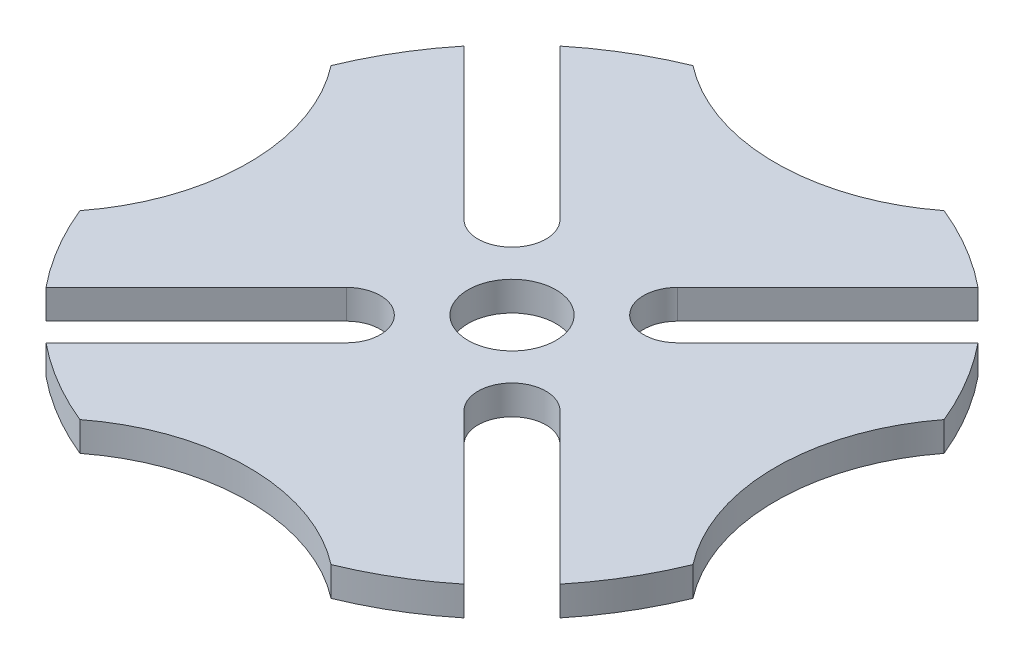
ISO-10303-21;
HEADER;
FILE_DESCRIPTION(('STEP AP214'),'2;1');
FILE_NAME('part.step','',(''),(''),'','','');
FILE_SCHEMA(('AUTOMOTIVE_DESIGN { 1 0 10303 214 1 1 1 1 }'));
ENDSEC;
DATA;
#1=APPLICATION_CONTEXT('core data for automotive mechanical design processes');
#2=APPLICATION_PROTOCOL_DEFINITION('international standard','automotive_design',2000,#1);
#3=PRODUCT_CONTEXT('',#1,'mechanical');
#4=PRODUCT('Part','Part','',(#3));
#5=PRODUCT_RELATED_PRODUCT_CATEGORY('part','',(#4));
#6=PRODUCT_DEFINITION_FORMATION('','',#4);
#7=PRODUCT_DEFINITION_CONTEXT('part definition',#1,'design');
#8=PRODUCT_DEFINITION('design','',#6,#7);
#9=PRODUCT_DEFINITION_SHAPE('','',#8);
#10=(LENGTH_UNIT() NAMED_UNIT(*) SI_UNIT(.MILLI.,.METRE.));
#11=(NAMED_UNIT(*) PLANE_ANGLE_UNIT() SI_UNIT($,.RADIAN.));
#12=(NAMED_UNIT(*) SI_UNIT($,.STERADIAN.) SOLID_ANGLE_UNIT());
#13=UNCERTAINTY_MEASURE_WITH_UNIT(LENGTH_MEASURE(1.E-05),#10,'distance_accuracy_value','');
#14=(GEOMETRIC_REPRESENTATION_CONTEXT(3) GLOBAL_UNCERTAINTY_ASSIGNED_CONTEXT((#13)) GLOBAL_UNIT_ASSIGNED_CONTEXT((#10,
#11,#12)) REPRESENTATION_CONTEXT('',''));
#15=CARTESIAN_POINT('',(0.,0.,0.));
#16=DIRECTION('',(0.,0.,1.));
#17=DIRECTION('',(1.,0.,0.));
#18=AXIS2_PLACEMENT_3D('',#15,#16,#17);
#19=CARTESIAN_POINT('',(0.,6.35,0.));
#20=DIRECTION('',(0.,1.,0.));
#21=DIRECTION('',(0.,0.,1.));
#22=AXIS2_PLACEMENT_3D('',#19,#20,#21);
#23=PLANE('',#22);
#24=CARTESIAN_POINT('',(0.,6.35,0.));
#25=DIRECTION('',(0.,1.,0.));
#26=DIRECTION('',(0.,0.,1.));
#27=AXIS2_PLACEMENT_3D('',#24,#25,#26);
#28=CIRCLE('',#27,9.525);
#29=CARTESIAN_POINT('',(0.,6.35,9.525));
#30=VERTEX_POINT('',#29);
#31=EDGE_CURVE('E246',#30,#30,#28,.T.);
#32=ORIENTED_EDGE('',*,*,#31,.F.);
#33=EDGE_LOOP('',(#32));
#34=FACE_BOUND('',#33,.T.);
#35=CARTESIAN_POINT('',(0.,6.35,0.));
#36=DIRECTION('',(0.,1.,0.));
#37=DIRECTION('',(0.,0.,1.));
#38=AXIS2_PLACEMENT_3D('',#35,#36,#37);
#39=CIRCLE('',#38,71.8312);
#40=CARTESIAN_POINT('',(45.3160164525584,6.35,-55.7331135529988));
#41=VERTEX_POINT('',#40);
#42=CARTESIAN_POINT('',(27.2324756423958,6.35,-66.4688916999999));
#43=VERTEX_POINT('',#42);
#44=EDGE_CURVE('E333',#41,#43,#39,.T.);
#45=ORIENTED_EDGE('',*,*,#44,.T.);
#46=CARTESIAN_POINT('',(3.42292092547125E-13,6.35,-101.6));
#47=DIRECTION('',(0.,-1.,0.));
#48=DIRECTION('',(1.,0.,0.));
#49=AXIS2_PLACEMENT_3D('',#46,#47,#48);
#50=CIRCLE('',#49,44.45);
#51=CARTESIAN_POINT('',(-27.2324756423954,6.35,-66.4688917000001));
#52=VERTEX_POINT('',#51);
#53=EDGE_CURVE('E330',#43,#52,#50,.T.);
#54=ORIENTED_EDGE('',*,*,#53,.T.);
#55=CARTESIAN_POINT('',(-45.3160164525584,6.35,-55.7331135529988));
#56=VERTEX_POINT('',#55);
#57=EDGE_CURVE('E332',#52,#56,#39,.T.);
#58=ORIENTED_EDGE('',*,*,#57,.T.);
#59=DIRECTION('',(-0.707106781186547,0.,-0.707106781186548));
#60=VECTOR('',#59,1.);
#61=CARTESIAN_POINT('',(-45.4690156051336,6.35,-55.886112705574));
#62=LINE('',#61,#60);
#63=CARTESIAN_POINT('',(-12.7519636919182,6.35,-23.1690607923584));
#64=VERTEX_POINT('',#63);
#65=EDGE_CURVE('E265',#64,#56,#62,.T.);
#66=ORIENTED_EDGE('',*,*,#65,.F.);
#67=CARTESIAN_POINT('',(-17.9605122421383,6.35,-17.9605122421383));
#68=DIRECTION('',(0.,1.,0.));
#69=DIRECTION('',(0.,0.,1.));
#70=AXIS2_PLACEMENT_3D('',#67,#68,#69);
#71=CIRCLE('',#70,7.366);
#72=CARTESIAN_POINT('',(-23.1690607923584,6.35,-12.7519636919182));
#73=VERTEX_POINT('',#72);
#74=EDGE_CURVE('E263',#73,#64,#71,.T.);
#75=ORIENTED_EDGE('',*,*,#74,.F.);
#76=DIRECTION('',(0.707106781186547,0.,0.707106781186548));
#77=VECTOR('',#76,1.);
#78=CARTESIAN_POINT('',(-55.8861127055739,6.35,-45.4690156051338));
#79=LINE('',#78,#77);
#80=CARTESIAN_POINT('',(-55.7331135529987,6.35,-45.3160164525586));
#81=VERTEX_POINT('',#80);
#82=EDGE_CURVE('E268',#81,#73,#79,.T.);
#83=ORIENTED_EDGE('',*,*,#82,.F.);
#84=CARTESIAN_POINT('',(-66.4688917,6.35,-27.2324756423956));
#85=VERTEX_POINT('',#84);
#86=EDGE_CURVE('E211',#81,#85,#39,.T.);
#87=ORIENTED_EDGE('',*,*,#86,.T.);
#88=CARTESIAN_POINT('',(-101.6,6.35,0.));
#89=DIRECTION('',(0.,-1.,0.));
#90=DIRECTION('',(0.,0.,-1.));
#91=AXIS2_PLACEMENT_3D('',#88,#89,#90);
#92=CIRCLE('',#91,44.45);
#93=CARTESIAN_POINT('',(-66.4688917,6.35,27.2324756423956));
#94=VERTEX_POINT('',#93);
#95=EDGE_CURVE('E339',#85,#94,#92,.T.);
#96=ORIENTED_EDGE('',*,*,#95,.T.);
#97=CARTESIAN_POINT('',(-55.7331135529986,6.35,45.3160164525586));
#98=VERTEX_POINT('',#97);
#99=EDGE_CURVE('E335',#94,#98,#39,.T.);
#100=ORIENTED_EDGE('',*,*,#99,.T.);
#101=DIRECTION('',(-0.707106781186546,0.,0.707106781186549));
#102=VECTOR('',#101,1.);
#103=CARTESIAN_POINT('',(-55.8861127055738,6.35,45.4690156051338));
#104=LINE('',#103,#102);
#105=CARTESIAN_POINT('',(-23.1690607923584,6.35,12.7519636919182));
#106=VERTEX_POINT('',#105);
#107=EDGE_CURVE('E392',#106,#98,#104,.T.);
#108=ORIENTED_EDGE('',*,*,#107,.F.);
#109=CARTESIAN_POINT('',(-17.9605122421383,6.35,17.9605122421383));
#110=DIRECTION('',(0.,1.,0.));
#111=DIRECTION('',(1.,0.,0.));
#112=AXIS2_PLACEMENT_3D('',#109,#110,#111);
#113=CIRCLE('',#112,7.366);
#114=CARTESIAN_POINT('',(-12.7519636919181,6.35,23.1690607923584));
#115=VERTEX_POINT('',#114);
#116=EDGE_CURVE('E397',#115,#106,#113,.T.);
#117=ORIENTED_EDGE('',*,*,#116,.F.);
#118=DIRECTION('',(0.707106781186546,0.,-0.707106781186549));
#119=VECTOR('',#118,1.);
#120=CARTESIAN_POINT('',(-45.4690156051336,6.35,55.886112705574));
#121=LINE('',#120,#119);
#122=CARTESIAN_POINT('',(-45.3160164525584,6.35,55.7331135529988));
#123=VERTEX_POINT('',#122);
#124=EDGE_CURVE('E394',#123,#115,#121,.T.);
#125=ORIENTED_EDGE('',*,*,#124,.F.);
#126=CARTESIAN_POINT('',(-27.2324756423963,6.35,66.4688916999997));
#127=VERTEX_POINT('',#126);
#128=EDGE_CURVE('E284',#123,#127,#39,.T.);
#129=ORIENTED_EDGE('',*,*,#128,.T.);
#130=CARTESIAN_POINT('',(-1.05176110060005E-12,6.35,101.6));
#131=DIRECTION('',(0.,-1.,0.));
#132=DIRECTION('',(-1.,0.,0.));
#133=AXIS2_PLACEMENT_3D('',#130,#131,#132);
#134=CIRCLE('',#133,44.45);
#135=CARTESIAN_POINT('',(27.2324756423949,6.35,66.4688917000003));
#136=VERTEX_POINT('',#135);
#137=EDGE_CURVE('E280',#127,#136,#134,.T.);
#138=ORIENTED_EDGE('',*,*,#137,.T.);
#139=CARTESIAN_POINT('',(45.316016452558,6.35,55.7331135529991));
#140=VERTEX_POINT('',#139);
#141=EDGE_CURVE('E283',#136,#140,#39,.T.);
#142=ORIENTED_EDGE('',*,*,#141,.T.);
#143=DIRECTION('',(0.707106781186542,0.,0.707106781186553));
#144=VECTOR('',#143,1.);
#145=CARTESIAN_POINT('',(45.4690156051332,6.35,55.8861127055743));
#146=LINE('',#145,#144);
#147=CARTESIAN_POINT('',(12.751963691918,6.35,23.1690607923585));
#148=VERTEX_POINT('',#147);
#149=EDGE_CURVE('E312',#148,#140,#146,.T.);
#150=ORIENTED_EDGE('',*,*,#149,.F.);
#151=CARTESIAN_POINT('',(17.9605122421382,6.35,17.9605122421385));
#152=DIRECTION('',(0.,1.,0.));
#153=DIRECTION('',(0.,0.,-1.));
#154=AXIS2_PLACEMENT_3D('',#151,#152,#153);
#155=CIRCLE('',#154,7.366);
#156=CARTESIAN_POINT('',(23.1690607923583,6.35,12.7519636919184));
#157=VERTEX_POINT('',#156);
#158=EDGE_CURVE('E310',#157,#148,#155,.T.);
#159=ORIENTED_EDGE('',*,*,#158,.F.);
#160=DIRECTION('',(-0.707106781186542,0.,-0.707106781186553));
#161=VECTOR('',#160,1.);
#162=CARTESIAN_POINT('',(55.8861127055735,6.35,45.4690156051341));
#163=LINE('',#162,#161);
#164=CARTESIAN_POINT('',(55.7331135529983,6.35,45.316016452559));
#165=VERTEX_POINT('',#164);
#166=EDGE_CURVE('E315',#165,#157,#163,.T.);
#167=ORIENTED_EDGE('',*,*,#166,.F.);
#168=CARTESIAN_POINT('',(66.4688917,6.35,27.2324756423956));
#169=VERTEX_POINT('',#168);
#170=EDGE_CURVE('E258',#165,#169,#39,.T.);
#171=ORIENTED_EDGE('',*,*,#170,.T.);
#172=CARTESIAN_POINT('',(101.6,6.35,0.));
#173=DIRECTION('',(0.,-1.,0.));
#174=DIRECTION('',(0.,0.,1.));
#175=AXIS2_PLACEMENT_3D('',#172,#173,#174);
#176=CIRCLE('',#175,44.45);
#177=CARTESIAN_POINT('',(66.4688917,6.35,-27.2324756423956));
#178=VERTEX_POINT('',#177);
#179=EDGE_CURVE('E254',#169,#178,#176,.T.);
#180=ORIENTED_EDGE('',*,*,#179,.T.);
#181=CARTESIAN_POINT('',(55.7331135529986,6.35,-45.3160164525586));
#182=VERTEX_POINT('',#181);
#183=EDGE_CURVE('E257',#178,#182,#39,.T.);
#184=ORIENTED_EDGE('',*,*,#183,.T.);
#185=DIRECTION('',(0.707106781186546,0.,-0.707106781186549));
#186=VECTOR('',#185,1.);
#187=CARTESIAN_POINT('',(55.8861127055738,6.35,-45.4690156051338));
#188=LINE('',#187,#186);
#189=CARTESIAN_POINT('',(23.1690607923584,6.35,-12.7519636919182));
#190=VERTEX_POINT('',#189);
#191=EDGE_CURVE('E291',#190,#182,#188,.T.);
#192=ORIENTED_EDGE('',*,*,#191,.F.);
#193=CARTESIAN_POINT('',(17.9605122421383,6.35,-17.9605122421383));
#194=DIRECTION('',(0.,1.,0.));
#195=DIRECTION('',(-1.,0.,0.));
#196=AXIS2_PLACEMENT_3D('',#193,#194,#195);
#197=CIRCLE('',#196,7.366);
#198=CARTESIAN_POINT('',(12.7519636919181,6.35,-23.1690607923584));
#199=VERTEX_POINT('',#198);
#200=EDGE_CURVE('E289',#199,#190,#197,.T.);
#201=ORIENTED_EDGE('',*,*,#200,.F.);
#202=DIRECTION('',(-0.707106781186546,0.,0.707106781186549));
#203=VECTOR('',#202,1.);
#204=CARTESIAN_POINT('',(45.4690156051336,6.35,-55.886112705574));
#205=LINE('',#204,#203);
#206=EDGE_CURVE('E294',#41,#199,#205,.T.);
#207=ORIENTED_EDGE('',*,*,#206,.F.);
#208=EDGE_LOOP('',(#45,#54,#58,#66,#75,#83,#87,#96,#100,#108,#117,#125,#129,#138,#142,#150,#159,
#167,#171,#180,#184,#192,#201,#207));
#209=FACE_BOUND('',#208,.T.);
#210=ADVANCED_FACE('F37',(#34,#209),#23,.T.);
#211=CARTESIAN_POINT('',(0.,0.,0.));
#212=DIRECTION('',(0.,1.,0.));
#213=DIRECTION('',(0.,0.,1.));
#214=AXIS2_PLACEMENT_3D('',#211,#212,#213);
#215=PLANE('',#214);
#216=CARTESIAN_POINT('',(0.,0.,0.));
#217=DIRECTION('',(0.,1.,0.));
#218=DIRECTION('',(0.,0.,1.));
#219=AXIS2_PLACEMENT_3D('',#216,#217,#218);
#220=CIRCLE('',#219,9.525);
#221=CARTESIAN_POINT('',(0.,0.,9.525));
#222=VERTEX_POINT('',#221);
#223=EDGE_CURVE('E242',#222,#222,#220,.T.);
#224=ORIENTED_EDGE('',*,*,#223,.T.);
#225=EDGE_LOOP('',(#224));
#226=FACE_BOUND('',#225,.T.);
#227=CARTESIAN_POINT('',(3.42292092547125E-13,0.,-101.6));
#228=DIRECTION('',(0.,-1.,0.));
#229=DIRECTION('',(1.,0.,0.));
#230=AXIS2_PLACEMENT_3D('',#227,#228,#229);
#231=CIRCLE('',#230,44.45);
#232=CARTESIAN_POINT('',(27.2324756423958,0.,-66.4688916999999));
#233=VERTEX_POINT('',#232);
#234=CARTESIAN_POINT('',(-27.2324756423954,0.,-66.4688917000001));
#235=VERTEX_POINT('',#234);
#236=EDGE_CURVE('E46',#233,#235,#231,.T.);
#237=ORIENTED_EDGE('',*,*,#236,.F.);
#238=CARTESIAN_POINT('',(0.,0.,0.));
#239=DIRECTION('',(0.,1.,0.));
#240=DIRECTION('',(0.,0.,1.));
#241=AXIS2_PLACEMENT_3D('',#238,#239,#240);
#242=CIRCLE('',#241,71.8312);
#243=CARTESIAN_POINT('',(45.3160164525584,0.,-55.7331135529988));
#244=VERTEX_POINT('',#243);
#245=EDGE_CURVE('E225',#244,#233,#242,.T.);
#246=ORIENTED_EDGE('',*,*,#245,.F.);
#247=DIRECTION('',(-0.707106781186546,0.,0.707106781186549));
#248=VECTOR('',#247,1.);
#249=CARTESIAN_POINT('',(45.4690156051336,0.,-55.886112705574));
#250=LINE('',#249,#248);
#251=CARTESIAN_POINT('',(12.7519636919181,0.,-23.1690607923584));
#252=VERTEX_POINT('',#251);
#253=EDGE_CURVE('E301',#244,#252,#250,.T.);
#254=ORIENTED_EDGE('',*,*,#253,.T.);
#255=CARTESIAN_POINT('',(17.9605122421383,0.,-17.9605122421383));
#256=DIRECTION('',(0.,1.,0.));
#257=DIRECTION('',(-1.,0.,0.));
#258=AXIS2_PLACEMENT_3D('',#255,#256,#257);
#259=CIRCLE('',#258,7.366);
#260=CARTESIAN_POINT('',(23.1690607923584,0.,-12.7519636919182));
#261=VERTEX_POINT('',#260);
#262=EDGE_CURVE('E297',#252,#261,#259,.T.);
#263=ORIENTED_EDGE('',*,*,#262,.T.);
#264=DIRECTION('',(0.707106781186546,0.,-0.707106781186549));
#265=VECTOR('',#264,1.);
#266=CARTESIAN_POINT('',(55.8861127055738,0.,-45.4690156051338));
#267=LINE('',#266,#265);
#268=CARTESIAN_POINT('',(55.7331135529986,0.,-45.3160164525586));
#269=VERTEX_POINT('',#268);
#270=EDGE_CURVE('E300',#261,#269,#267,.T.);
#271=ORIENTED_EDGE('',*,*,#270,.T.);
#272=CARTESIAN_POINT('',(66.4688917,0.,-27.2324756423957));
#273=VERTEX_POINT('',#272);
#274=EDGE_CURVE('E369',#273,#269,#242,.T.);
#275=ORIENTED_EDGE('',*,*,#274,.F.);
#276=CARTESIAN_POINT('',(101.6,0.,0.));
#277=DIRECTION('',(0.,-1.,0.));
#278=DIRECTION('',(0.,0.,1.));
#279=AXIS2_PLACEMENT_3D('',#276,#277,#278);
#280=CIRCLE('',#279,44.45);
#281=CARTESIAN_POINT('',(66.4688917,0.,27.2324756423956));
#282=VERTEX_POINT('',#281);
#283=EDGE_CURVE('E250',#282,#273,#280,.T.);
#284=ORIENTED_EDGE('',*,*,#283,.F.);
#285=CARTESIAN_POINT('',(55.7331135529983,0.,45.316016452559));
#286=VERTEX_POINT('',#285);
#287=EDGE_CURVE('E253',#286,#282,#242,.T.);
#288=ORIENTED_EDGE('',*,*,#287,.F.);
#289=DIRECTION('',(-0.707106781186542,0.,-0.707106781186553));
#290=VECTOR('',#289,1.);
#291=CARTESIAN_POINT('',(55.8861127055735,0.,45.4690156051341));
#292=LINE('',#291,#290);
#293=CARTESIAN_POINT('',(23.1690607923583,0.,12.7519636919184));
#294=VERTEX_POINT('',#293);
#295=EDGE_CURVE('E306',#286,#294,#292,.T.);
#296=ORIENTED_EDGE('',*,*,#295,.T.);
#297=CARTESIAN_POINT('',(17.9605122421382,0.,17.9605122421385));
#298=DIRECTION('',(0.,1.,0.));
#299=DIRECTION('',(0.,0.,-1.));
#300=AXIS2_PLACEMENT_3D('',#297,#298,#299);
#301=CIRCLE('',#300,7.366);
#302=CARTESIAN_POINT('',(12.751963691918,0.,23.1690607923585));
#303=VERTEX_POINT('',#302);
#304=EDGE_CURVE('E318',#294,#303,#301,.T.);
#305=ORIENTED_EDGE('',*,*,#304,.T.);
#306=DIRECTION('',(0.707106781186542,0.,0.707106781186553));
#307=VECTOR('',#306,1.);
#308=CARTESIAN_POINT('',(45.4690156051332,0.,55.8861127055743));
#309=LINE('',#308,#307);
#310=CARTESIAN_POINT('',(45.316016452558,0.,55.7331135529991));
#311=VERTEX_POINT('',#310);
#312=EDGE_CURVE('E321',#303,#311,#309,.T.);
#313=ORIENTED_EDGE('',*,*,#312,.T.);
#314=CARTESIAN_POINT('',(27.2324756423949,0.,66.4688917000003));
#315=VERTEX_POINT('',#314);
#316=EDGE_CURVE('E221',#315,#311,#242,.T.);
#317=ORIENTED_EDGE('',*,*,#316,.F.);
#318=CARTESIAN_POINT('',(-1.05176110060005E-12,0.,101.6));
#319=DIRECTION('',(0.,-1.,0.));
#320=DIRECTION('',(-1.,0.,0.));
#321=AXIS2_PLACEMENT_3D('',#318,#319,#320);
#322=CIRCLE('',#321,44.45);
#323=CARTESIAN_POINT('',(-27.2324756423963,0.,66.4688916999997));
#324=VERTEX_POINT('',#323);
#325=EDGE_CURVE('E278',#324,#315,#322,.T.);
#326=ORIENTED_EDGE('',*,*,#325,.F.);
#327=CARTESIAN_POINT('',(-45.3160164525584,0.,55.7331135529988));
#328=VERTEX_POINT('',#327);
#329=EDGE_CURVE('E40',#328,#324,#242,.T.);
#330=ORIENTED_EDGE('',*,*,#329,.F.);
#331=DIRECTION('',(0.707106781186546,0.,-0.707106781186549));
#332=VECTOR('',#331,1.);
#333=CARTESIAN_POINT('',(-45.4690156051336,0.,55.886112705574));
#334=LINE('',#333,#332);
#335=CARTESIAN_POINT('',(-12.7519636919181,0.,23.1690607923584));
#336=VERTEX_POINT('',#335);
#337=EDGE_CURVE('E325',#328,#336,#334,.T.);
#338=ORIENTED_EDGE('',*,*,#337,.T.);
#339=CARTESIAN_POINT('',(-17.9605122421383,0.,17.9605122421383));
#340=DIRECTION('',(0.,1.,0.));
#341=DIRECTION('',(1.,0.,0.));
#342=AXIS2_PLACEMENT_3D('',#339,#340,#341);
#343=CIRCLE('',#342,7.366);
#344=CARTESIAN_POINT('',(-23.1690607923584,0.,12.7519636919182));
#345=VERTEX_POINT('',#344);
#346=EDGE_CURVE('E387',#336,#345,#343,.T.);
#347=ORIENTED_EDGE('',*,*,#346,.T.);
#348=DIRECTION('',(-0.707106781186546,0.,0.707106781186549));
#349=VECTOR('',#348,1.);
#350=CARTESIAN_POINT('',(-55.8861127055738,0.,45.4690156051338));
#351=LINE('',#350,#349);
#352=CARTESIAN_POINT('',(-55.7331135529986,0.,45.3160164525586));
#353=VERTEX_POINT('',#352);
#354=EDGE_CURVE('E203',#345,#353,#351,.T.);
#355=ORIENTED_EDGE('',*,*,#354,.T.);
#356=CARTESIAN_POINT('',(-66.4688917,0.,27.2324756423957));
#357=VERTEX_POINT('',#356);
#358=EDGE_CURVE('E227',#357,#353,#242,.T.);
#359=ORIENTED_EDGE('',*,*,#358,.F.);
#360=CARTESIAN_POINT('',(-101.6,0.,0.));
#361=DIRECTION('',(0.,-1.,0.));
#362=DIRECTION('',(0.,0.,-1.));
#363=AXIS2_PLACEMENT_3D('',#360,#361,#362);
#364=CIRCLE('',#363,44.45);
#365=CARTESIAN_POINT('',(-66.4688917,0.,-27.2324756423956));
#366=VERTEX_POINT('',#365);
#367=EDGE_CURVE('E218',#366,#357,#364,.T.);
#368=ORIENTED_EDGE('',*,*,#367,.F.);
#369=CARTESIAN_POINT('',(-55.7331135529987,0.,-45.3160164525586));
#370=VERTEX_POINT('',#369);
#371=EDGE_CURVE('E209',#370,#366,#242,.T.);
#372=ORIENTED_EDGE('',*,*,#371,.F.);
#373=DIRECTION('',(0.707106781186547,0.,0.707106781186548));
#374=VECTOR('',#373,1.);
#375=CARTESIAN_POINT('',(-55.8861127055739,0.,-45.4690156051338));
#376=LINE('',#375,#374);
#377=CARTESIAN_POINT('',(-23.1690607923584,0.,-12.7519636919182));
#378=VERTEX_POINT('',#377);
#379=EDGE_CURVE('E191',#370,#378,#376,.T.);
#380=ORIENTED_EDGE('',*,*,#379,.T.);
#381=CARTESIAN_POINT('',(-17.9605122421383,0.,-17.9605122421383));
#382=DIRECTION('',(0.,1.,0.));
#383=DIRECTION('',(0.,0.,1.));
#384=AXIS2_PLACEMENT_3D('',#381,#382,#383);
#385=CIRCLE('',#384,7.366);
#386=CARTESIAN_POINT('',(-12.7519636919182,0.,-23.1690607923584));
#387=VERTEX_POINT('',#386);
#388=EDGE_CURVE('E202',#378,#387,#385,.T.);
#389=ORIENTED_EDGE('',*,*,#388,.T.);
#390=DIRECTION('',(-0.707106781186547,0.,-0.707106781186548));
#391=VECTOR('',#390,1.);
#392=CARTESIAN_POINT('',(-45.4690156051336,0.,-55.886112705574));
#393=LINE('',#392,#391);
#394=CARTESIAN_POINT('',(-45.3160164525584,0.,-55.7331135529988));
#395=VERTEX_POINT('',#394);
#396=EDGE_CURVE('E271',#387,#395,#393,.T.);
#397=ORIENTED_EDGE('',*,*,#396,.T.);
#398=EDGE_CURVE('E220',#235,#395,#242,.T.);
#399=ORIENTED_EDGE('',*,*,#398,.F.);
#400=EDGE_LOOP('',(#237,#246,#254,#263,#271,#275,#284,#288,#296,#305,#313,#317,#326,#330,#338,
#347,#355,#359,#368,#372,#380,#389,#397,#399));
#401=FACE_BOUND('',#400,.T.);
#402=ADVANCED_FACE('F216',(#226,#401),#215,.F.);
#403=CARTESIAN_POINT('',(0.,6.35,0.));
#404=DIRECTION('',(0.,-1.,0.));
#405=DIRECTION('',(0.,0.,-1.));
#406=AXIS2_PLACEMENT_3D('',#403,#404,#405);
#407=CYLINDRICAL_SURFACE('',#406,71.8312);
#408=DIRECTION('',(0.,1.,0.));
#409=VECTOR('',#408,1.);
#410=CARTESIAN_POINT('',(27.2324756423958,0.,-66.4688916999999));
#411=LINE('',#410,#409);
#412=EDGE_CURVE('E275',#233,#43,#411,.T.);
#413=ORIENTED_EDGE('',*,*,#412,.T.);
#414=ORIENTED_EDGE('',*,*,#44,.F.);
#415=DIRECTION('',(0.,-1.,0.));
#416=VECTOR('',#415,1.);
#417=CARTESIAN_POINT('',(45.3160164525584,6.35,-55.7331135529988));
#418=LINE('',#417,#416);
#419=EDGE_CURVE('E329',#41,#244,#418,.T.);
#420=ORIENTED_EDGE('',*,*,#419,.T.);
#421=ORIENTED_EDGE('',*,*,#245,.T.);
#422=EDGE_LOOP('',(#413,#414,#420,#421));
#423=FACE_BOUND('',#422,.T.);
#424=ADVANCED_FACE('F412',(#423),#407,.T.);
#425=DIRECTION('',(0.,1.,0.));
#426=VECTOR('',#425,1.);
#427=CARTESIAN_POINT('',(-27.2324756423954,0.,-66.4688917000001));
#428=LINE('',#427,#426);
#429=EDGE_CURVE('E11',#235,#52,#428,.T.);
#430=ORIENTED_EDGE('',*,*,#429,.F.);
#431=ORIENTED_EDGE('',*,*,#398,.T.);
#432=DIRECTION('',(0.,-1.,0.));
#433=VECTOR('',#432,1.);
#434=CARTESIAN_POINT('',(-45.3160164525584,6.35,-55.7331135529988));
#435=LINE('',#434,#433);
#436=EDGE_CURVE('E224',#395,#56,#435,.F.);
#437=ORIENTED_EDGE('',*,*,#436,.T.);
#438=ORIENTED_EDGE('',*,*,#57,.F.);
#439=EDGE_LOOP('',(#430,#431,#437,#438));
#440=FACE_BOUND('',#439,.T.);
#441=ADVANCED_FACE('F417',(#440),#407,.T.);
#442=ORIENTED_EDGE('',*,*,#170,.F.);
#443=DIRECTION('',(0.,-1.,0.));
#444=VECTOR('',#443,1.);
#445=CARTESIAN_POINT('',(55.7331135529983,6.35,45.3160164525589));
#446=LINE('',#445,#444);
#447=EDGE_CURVE('E373',#165,#286,#446,.T.);
#448=ORIENTED_EDGE('',*,*,#447,.T.);
#449=ORIENTED_EDGE('',*,*,#287,.T.);
#450=DIRECTION('',(0.,1.,0.));
#451=VECTOR('',#450,1.);
#452=CARTESIAN_POINT('',(66.4688917,0.,27.2324756423956));
#453=LINE('',#452,#451);
#454=EDGE_CURVE('E212',#282,#169,#453,.T.);
#455=ORIENTED_EDGE('',*,*,#454,.T.);
#456=EDGE_LOOP('',(#442,#448,#449,#455));
#457=FACE_BOUND('',#456,.T.);
#458=ADVANCED_FACE('F497',(#457),#407,.T.);
#459=ORIENTED_EDGE('',*,*,#86,.F.);
#460=DIRECTION('',(0.,-1.,0.));
#461=VECTOR('',#460,1.);
#462=CARTESIAN_POINT('',(-55.7331135529986,6.35,-45.3160164525586));
#463=LINE('',#462,#461);
#464=EDGE_CURVE('E194',#81,#370,#463,.T.);
#465=ORIENTED_EDGE('',*,*,#464,.T.);
#466=ORIENTED_EDGE('',*,*,#371,.T.);
#467=DIRECTION('',(0.,1.,0.));
#468=VECTOR('',#467,1.);
#469=CARTESIAN_POINT('',(-66.4688917,0.,-27.2324756423956));
#470=LINE('',#469,#468);
#471=EDGE_CURVE('E219',#366,#85,#470,.T.);
#472=ORIENTED_EDGE('',*,*,#471,.T.);
#473=EDGE_LOOP('',(#459,#465,#466,#472));
#474=FACE_BOUND('',#473,.T.);
#475=ADVANCED_FACE('F207',(#474),#407,.T.);
#476=ORIENTED_EDGE('',*,*,#316,.T.);
#477=DIRECTION('',(0.,-1.,0.));
#478=VECTOR('',#477,1.);
#479=CARTESIAN_POINT('',(45.316016452558,6.35,55.7331135529991));
#480=LINE('',#479,#478);
#481=EDGE_CURVE('E366',#311,#140,#480,.F.);
#482=ORIENTED_EDGE('',*,*,#481,.T.);
#483=ORIENTED_EDGE('',*,*,#141,.F.);
#484=DIRECTION('',(0.,1.,0.));
#485=VECTOR('',#484,1.);
#486=CARTESIAN_POINT('',(27.2324756423949,0.,66.4688917000003));
#487=LINE('',#486,#485);
#488=EDGE_CURVE('E276',#315,#136,#487,.T.);
#489=ORIENTED_EDGE('',*,*,#488,.F.);
#490=EDGE_LOOP('',(#476,#482,#483,#489));
#491=FACE_BOUND('',#490,.T.);
#492=ADVANCED_FACE('F364',(#491),#407,.T.);
#493=DIRECTION('',(0.,1.,0.));
#494=VECTOR('',#493,1.);
#495=CARTESIAN_POINT('',(66.4688917,0.,-27.2324756423956));
#496=LINE('',#495,#494);
#497=EDGE_CURVE('E247',#273,#178,#496,.T.);
#498=ORIENTED_EDGE('',*,*,#497,.F.);
#499=ORIENTED_EDGE('',*,*,#274,.T.);
#500=DIRECTION('',(0.,-1.,0.));
#501=VECTOR('',#500,1.);
#502=CARTESIAN_POINT('',(55.7331135529986,6.35,-45.3160164525586));
#503=LINE('',#502,#501);
#504=EDGE_CURVE('E238',#269,#182,#503,.F.);
#505=ORIENTED_EDGE('',*,*,#504,.T.);
#506=ORIENTED_EDGE('',*,*,#183,.F.);
#507=EDGE_LOOP('',(#498,#499,#505,#506));
#508=FACE_BOUND('',#507,.T.);
#509=ADVANCED_FACE('F505',(#508),#407,.T.);
#510=DIRECTION('',(0.,1.,0.));
#511=VECTOR('',#510,1.);
#512=CARTESIAN_POINT('',(-27.2324756423963,0.,66.4688916999997));
#513=LINE('',#512,#511);
#514=EDGE_CURVE('E235',#324,#127,#513,.T.);
#515=ORIENTED_EDGE('',*,*,#514,.T.);
#516=ORIENTED_EDGE('',*,*,#128,.F.);
#517=DIRECTION('',(0.,-1.,0.));
#518=VECTOR('',#517,1.);
#519=CARTESIAN_POINT('',(-45.3160164525584,6.35,55.7331135529988));
#520=LINE('',#519,#518);
#521=EDGE_CURVE('E228',#123,#328,#520,.T.);
#522=ORIENTED_EDGE('',*,*,#521,.T.);
#523=ORIENTED_EDGE('',*,*,#329,.T.);
#524=EDGE_LOOP('',(#515,#516,#522,#523));
#525=FACE_BOUND('',#524,.T.);
#526=ADVANCED_FACE('F423',(#525),#407,.T.);
#527=DIRECTION('',(0.,1.,0.));
#528=VECTOR('',#527,1.);
#529=CARTESIAN_POINT('',(-66.4688917,0.,27.2324756423956));
#530=LINE('',#529,#528);
#531=EDGE_CURVE('E286',#357,#94,#530,.T.);
#532=ORIENTED_EDGE('',*,*,#531,.F.);
#533=ORIENTED_EDGE('',*,*,#358,.T.);
#534=DIRECTION('',(0.,-1.,0.));
#535=VECTOR('',#534,1.);
#536=CARTESIAN_POINT('',(-55.7331135529986,6.35,45.3160164525586));
#537=LINE('',#536,#535);
#538=EDGE_CURVE('E234',#353,#98,#537,.F.);
#539=ORIENTED_EDGE('',*,*,#538,.T.);
#540=ORIENTED_EDGE('',*,*,#99,.F.);
#541=EDGE_LOOP('',(#532,#533,#539,#540));
#542=FACE_BOUND('',#541,.T.);
#543=ADVANCED_FACE('F420',(#542),#407,.T.);
#544=CARTESIAN_POINT('',(0.,6.35,0.));
#545=DIRECTION('',(0.,-1.,0.));
#546=DIRECTION('',(0.,0.,-1.));
#547=AXIS2_PLACEMENT_3D('',#544,#545,#546);
#548=CYLINDRICAL_SURFACE('',#547,9.525);
#549=ORIENTED_EDGE('',*,*,#31,.T.);
#550=EDGE_LOOP('',(#549));
#551=FACE_BOUND('',#550,.T.);
#552=ORIENTED_EDGE('',*,*,#223,.F.);
#553=EDGE_LOOP('',(#552));
#554=FACE_BOUND('',#553,.T.);
#555=ADVANCED_FACE('F405',(#551,#554),#548,.F.);
#556=CARTESIAN_POINT('',(-55.8861127055738,0.,45.4690156051338));
#557=DIRECTION('',(-0.707106781186549,0.,-0.707106781186546));
#558=DIRECTION('',(-0.707106781186546,0.,0.707106781186549));
#559=AXIS2_PLACEMENT_3D('',#556,#557,#558);
#560=PLANE('',#559);
#561=ORIENTED_EDGE('',*,*,#354,.F.);
#562=DIRECTION('',(0.,1.,0.));
#563=VECTOR('',#562,1.);
#564=CARTESIAN_POINT('',(-23.1690607923584,0.,12.7519636919182));
#565=LINE('',#564,#563);
#566=EDGE_CURVE('E395',#345,#106,#565,.T.);
#567=ORIENTED_EDGE('',*,*,#566,.T.);
#568=ORIENTED_EDGE('',*,*,#107,.T.);
#569=ORIENTED_EDGE('',*,*,#538,.F.);
#570=EDGE_LOOP('',(#561,#567,#568,#569));
#571=FACE_BOUND('',#570,.T.);
#572=ADVANCED_FACE('F472',(#571),#560,.F.);
#573=CARTESIAN_POINT('',(-45.4690156051336,0.,55.886112705574));
#574=DIRECTION('',(0.707106781186549,0.,0.707106781186546));
#575=DIRECTION('',(0.707106781186546,0.,-0.707106781186549));
#576=AXIS2_PLACEMENT_3D('',#573,#574,#575);
#577=PLANE('',#576);
#578=ORIENTED_EDGE('',*,*,#124,.T.);
#579=DIRECTION('',(0.,1.,0.));
#580=VECTOR('',#579,1.);
#581=CARTESIAN_POINT('',(-12.7519636919181,0.,23.1690607923584));
#582=LINE('',#581,#580);
#583=EDGE_CURVE('E382',#336,#115,#582,.T.);
#584=ORIENTED_EDGE('',*,*,#583,.F.);
#585=ORIENTED_EDGE('',*,*,#337,.F.);
#586=ORIENTED_EDGE('',*,*,#521,.F.);
#587=EDGE_LOOP('',(#578,#584,#585,#586));
#588=FACE_BOUND('',#587,.T.);
#589=ADVANCED_FACE('F475',(#588),#577,.F.);
#590=CARTESIAN_POINT('',(-17.9605122421383,0.,17.9605122421383));
#591=DIRECTION('',(0.,1.,0.));
#592=DIRECTION('',(0.,0.,1.));
#593=AXIS2_PLACEMENT_3D('',#590,#591,#592);
#594=CYLINDRICAL_SURFACE('',#593,7.366);
#595=ORIENTED_EDGE('',*,*,#116,.T.);
#596=ORIENTED_EDGE('',*,*,#566,.F.);
#597=ORIENTED_EDGE('',*,*,#346,.F.);
#598=ORIENTED_EDGE('',*,*,#583,.T.);
#599=EDGE_LOOP('',(#595,#596,#597,#598));
#600=FACE_BOUND('',#599,.T.);
#601=ADVANCED_FACE('F479',(#600),#594,.F.);
#602=CARTESIAN_POINT('',(-101.6,0.,0.));
#603=DIRECTION('',(0.,1.,0.));
#604=DIRECTION('',(0.,0.,1.));
#605=AXIS2_PLACEMENT_3D('',#602,#603,#604);
#606=CYLINDRICAL_SURFACE('',#605,44.45);
#607=ORIENTED_EDGE('',*,*,#95,.F.);
#608=ORIENTED_EDGE('',*,*,#471,.F.);
#609=ORIENTED_EDGE('',*,*,#367,.T.);
#610=ORIENTED_EDGE('',*,*,#531,.T.);
#611=EDGE_LOOP('',(#607,#608,#609,#610));
#612=FACE_BOUND('',#611,.T.);
#613=ADVANCED_FACE('F456',(#612),#606,.F.);
#614=CARTESIAN_POINT('',(-1.05176110060005E-12,0.,101.6));
#615=DIRECTION('',(0.,1.,0.));
#616=DIRECTION('',(0.,0.,1.));
#617=AXIS2_PLACEMENT_3D('',#614,#615,#616);
#618=CYLINDRICAL_SURFACE('',#617,44.45);
#619=ORIENTED_EDGE('',*,*,#137,.F.);
#620=ORIENTED_EDGE('',*,*,#514,.F.);
#621=ORIENTED_EDGE('',*,*,#325,.T.);
#622=ORIENTED_EDGE('',*,*,#488,.T.);
#623=EDGE_LOOP('',(#619,#620,#621,#622));
#624=FACE_BOUND('',#623,.T.);
#625=ADVANCED_FACE('F452',(#624),#618,.F.);
#626=CARTESIAN_POINT('',(55.8861127055738,0.,-45.4690156051338));
#627=DIRECTION('',(0.707106781186549,0.,0.707106781186546));
#628=DIRECTION('',(0.707106781186546,0.,-0.707106781186549));
#629=AXIS2_PLACEMENT_3D('',#626,#627,#628);
#630=PLANE('',#629);
#631=ORIENTED_EDGE('',*,*,#270,.F.);
#632=DIRECTION('',(0.,1.,0.));
#633=VECTOR('',#632,1.);
#634=CARTESIAN_POINT('',(23.1690607923584,0.,-12.7519636919182));
#635=LINE('',#634,#633);
#636=EDGE_CURVE('E277',#261,#190,#635,.T.);
#637=ORIENTED_EDGE('',*,*,#636,.T.);
#638=ORIENTED_EDGE('',*,*,#191,.T.);
#639=ORIENTED_EDGE('',*,*,#504,.F.);
#640=EDGE_LOOP('',(#631,#637,#638,#639));
#641=FACE_BOUND('',#640,.T.);
#642=ADVANCED_FACE('F448',(#641),#630,.F.);
#643=CARTESIAN_POINT('',(45.4690156051336,0.,-55.886112705574));
#644=DIRECTION('',(-0.707106781186549,0.,-0.707106781186546));
#645=DIRECTION('',(-0.707106781186546,0.,0.707106781186549));
#646=AXIS2_PLACEMENT_3D('',#643,#644,#645);
#647=PLANE('',#646);
#648=ORIENTED_EDGE('',*,*,#206,.T.);
#649=DIRECTION('',(0.,1.,0.));
#650=VECTOR('',#649,1.);
#651=CARTESIAN_POINT('',(12.7519636919181,0.,-23.1690607923584));
#652=LINE('',#651,#650);
#653=EDGE_CURVE('E260',#252,#199,#652,.T.);
#654=ORIENTED_EDGE('',*,*,#653,.F.);
#655=ORIENTED_EDGE('',*,*,#253,.F.);
#656=ORIENTED_EDGE('',*,*,#419,.F.);
#657=EDGE_LOOP('',(#648,#654,#655,#656));
#658=FACE_BOUND('',#657,.T.);
#659=ADVANCED_FACE('F444',(#658),#647,.F.);
#660=CARTESIAN_POINT('',(17.9605122421383,0.,-17.9605122421383));
#661=DIRECTION('',(0.,1.,0.));
#662=DIRECTION('',(0.,0.,1.));
#663=AXIS2_PLACEMENT_3D('',#660,#661,#662);
#664=CYLINDRICAL_SURFACE('',#663,7.366);
#665=ORIENTED_EDGE('',*,*,#200,.T.);
#666=ORIENTED_EDGE('',*,*,#636,.F.);
#667=ORIENTED_EDGE('',*,*,#262,.F.);
#668=ORIENTED_EDGE('',*,*,#653,.T.);
#669=EDGE_LOOP('',(#665,#666,#667,#668));
#670=FACE_BOUND('',#669,.T.);
#671=ADVANCED_FACE('F440',(#670),#664,.F.);
#672=CARTESIAN_POINT('',(101.6,0.,0.));
#673=DIRECTION('',(0.,1.,0.));
#674=DIRECTION('',(0.,0.,1.));
#675=AXIS2_PLACEMENT_3D('',#672,#673,#674);
#676=CYLINDRICAL_SURFACE('',#675,44.45);
#677=ORIENTED_EDGE('',*,*,#179,.F.);
#678=ORIENTED_EDGE('',*,*,#454,.F.);
#679=ORIENTED_EDGE('',*,*,#283,.T.);
#680=ORIENTED_EDGE('',*,*,#497,.T.);
#681=EDGE_LOOP('',(#677,#678,#679,#680));
#682=FACE_BOUND('',#681,.T.);
#683=ADVANCED_FACE('F443',(#682),#676,.F.);
#684=CARTESIAN_POINT('',(-45.4690156051336,0.,-55.886112705574));
#685=DIRECTION('',(0.707106781186548,0.,-0.707106781186547));
#686=DIRECTION('',(-0.707106781186547,0.,-0.707106781186548));
#687=AXIS2_PLACEMENT_3D('',#684,#685,#686);
#688=PLANE('',#687);
#689=ORIENTED_EDGE('',*,*,#396,.F.);
#690=DIRECTION('',(0.,1.,0.));
#691=VECTOR('',#690,1.);
#692=CARTESIAN_POINT('',(-12.7519636919182,0.,-23.1690607923584));
#693=LINE('',#692,#691);
#694=EDGE_CURVE('E249',#387,#64,#693,.T.);
#695=ORIENTED_EDGE('',*,*,#694,.T.);
#696=ORIENTED_EDGE('',*,*,#65,.T.);
#697=ORIENTED_EDGE('',*,*,#436,.F.);
#698=EDGE_LOOP('',(#689,#695,#696,#697));
#699=FACE_BOUND('',#698,.T.);
#700=ADVANCED_FACE('F463',(#699),#688,.F.);
#701=CARTESIAN_POINT('',(-55.8861127055739,0.,-45.4690156051338));
#702=DIRECTION('',(-0.707106781186548,0.,0.707106781186547));
#703=DIRECTION('',(0.707106781186547,0.,0.707106781186548));
#704=AXIS2_PLACEMENT_3D('',#701,#702,#703);
#705=PLANE('',#704);
#706=ORIENTED_EDGE('',*,*,#82,.T.);
#707=DIRECTION('',(0.,1.,0.));
#708=VECTOR('',#707,1.);
#709=CARTESIAN_POINT('',(-23.1690607923584,0.,-12.7519636919182));
#710=LINE('',#709,#708);
#711=EDGE_CURVE('E197',#378,#73,#710,.T.);
#712=ORIENTED_EDGE('',*,*,#711,.F.);
#713=ORIENTED_EDGE('',*,*,#379,.F.);
#714=ORIENTED_EDGE('',*,*,#464,.F.);
#715=EDGE_LOOP('',(#706,#712,#713,#714));
#716=FACE_BOUND('',#715,.T.);
#717=ADVANCED_FACE('F193',(#716),#705,.F.);
#718=CARTESIAN_POINT('',(-17.9605122421383,0.,-17.9605122421383));
#719=DIRECTION('',(0.,1.,0.));
#720=DIRECTION('',(0.,0.,1.));
#721=AXIS2_PLACEMENT_3D('',#718,#719,#720);
#722=CYLINDRICAL_SURFACE('',#721,7.366);
#723=ORIENTED_EDGE('',*,*,#74,.T.);
#724=ORIENTED_EDGE('',*,*,#694,.F.);
#725=ORIENTED_EDGE('',*,*,#388,.F.);
#726=ORIENTED_EDGE('',*,*,#711,.T.);
#727=EDGE_LOOP('',(#723,#724,#725,#726));
#728=FACE_BOUND('',#727,.T.);
#729=ADVANCED_FACE('F439',(#728),#722,.F.);
#730=CARTESIAN_POINT('',(45.4690156051332,0.,55.8861127055743));
#731=DIRECTION('',(-0.707106781186553,0.,0.707106781186542));
#732=DIRECTION('',(0.707106781186542,0.,0.707106781186553));
#733=AXIS2_PLACEMENT_3D('',#730,#731,#732);
#734=PLANE('',#733);
#735=ORIENTED_EDGE('',*,*,#312,.F.);
#736=DIRECTION('',(0.,1.,0.));
#737=VECTOR('',#736,1.);
#738=CARTESIAN_POINT('',(12.751963691918,0.,23.1690607923585));
#739=LINE('',#738,#737);
#740=EDGE_CURVE('E262',#303,#148,#739,.T.);
#741=ORIENTED_EDGE('',*,*,#740,.T.);
#742=ORIENTED_EDGE('',*,*,#149,.T.);
#743=ORIENTED_EDGE('',*,*,#481,.F.);
#744=EDGE_LOOP('',(#735,#741,#742,#743));
#745=FACE_BOUND('',#744,.T.);
#746=ADVANCED_FACE('F435',(#745),#734,.F.);
#747=CARTESIAN_POINT('',(55.8861127055735,0.,45.4690156051341));
#748=DIRECTION('',(0.707106781186553,0.,-0.707106781186542));
#749=DIRECTION('',(-0.707106781186542,0.,-0.707106781186553));
#750=AXIS2_PLACEMENT_3D('',#747,#748,#749);
#751=PLANE('',#750);
#752=ORIENTED_EDGE('',*,*,#166,.T.);
#753=DIRECTION('',(0.,1.,0.));
#754=VECTOR('',#753,1.);
#755=CARTESIAN_POINT('',(23.1690607923583,0.,12.7519636919184));
#756=LINE('',#755,#754);
#757=EDGE_CURVE('E307',#294,#157,#756,.T.);
#758=ORIENTED_EDGE('',*,*,#757,.F.);
#759=ORIENTED_EDGE('',*,*,#295,.F.);
#760=ORIENTED_EDGE('',*,*,#447,.F.);
#761=EDGE_LOOP('',(#752,#758,#759,#760));
#762=FACE_BOUND('',#761,.T.);
#763=ADVANCED_FACE('F431',(#762),#751,.F.);
#764=CARTESIAN_POINT('',(17.9605122421382,0.,17.9605122421385));
#765=DIRECTION('',(0.,1.,0.));
#766=DIRECTION('',(0.,0.,1.));
#767=AXIS2_PLACEMENT_3D('',#764,#765,#766);
#768=CYLINDRICAL_SURFACE('',#767,7.366);
#769=ORIENTED_EDGE('',*,*,#158,.T.);
#770=ORIENTED_EDGE('',*,*,#740,.F.);
#771=ORIENTED_EDGE('',*,*,#304,.F.);
#772=ORIENTED_EDGE('',*,*,#757,.T.);
#773=EDGE_LOOP('',(#769,#770,#771,#772));
#774=FACE_BOUND('',#773,.T.);
#775=ADVANCED_FACE('F428',(#774),#768,.F.);
#776=CARTESIAN_POINT('',(3.42292092547125E-13,0.,-101.6));
#777=DIRECTION('',(0.,1.,0.));
#778=DIRECTION('',(0.,0.,1.));
#779=AXIS2_PLACEMENT_3D('',#776,#777,#778);
#780=CYLINDRICAL_SURFACE('',#779,44.45);
#781=ORIENTED_EDGE('',*,*,#53,.F.);
#782=ORIENTED_EDGE('',*,*,#412,.F.);
#783=ORIENTED_EDGE('',*,*,#236,.T.);
#784=ORIENTED_EDGE('',*,*,#429,.T.);
#785=EDGE_LOOP('',(#781,#782,#783,#784));
#786=FACE_BOUND('',#785,.T.);
#787=ADVANCED_FACE('F425',(#786),#780,.F.);
#788=CLOSED_SHELL('',(#210,#402,#424,#441,#458,#475,#492,#509,#526,#543,#555,#572,#589,#601,
#613,#625,#642,#659,#671,#683,#700,#717,#729,#746,#763,#775,#787));
#789=MANIFOLD_SOLID_BREP('B2',#788);
#790=ADVANCED_BREP_SHAPE_REPRESENTATION('',(#18,#789),#14);
#791=SHAPE_DEFINITION_REPRESENTATION(#9,#790);
ENDSEC;
END-ISO-10303-21;
